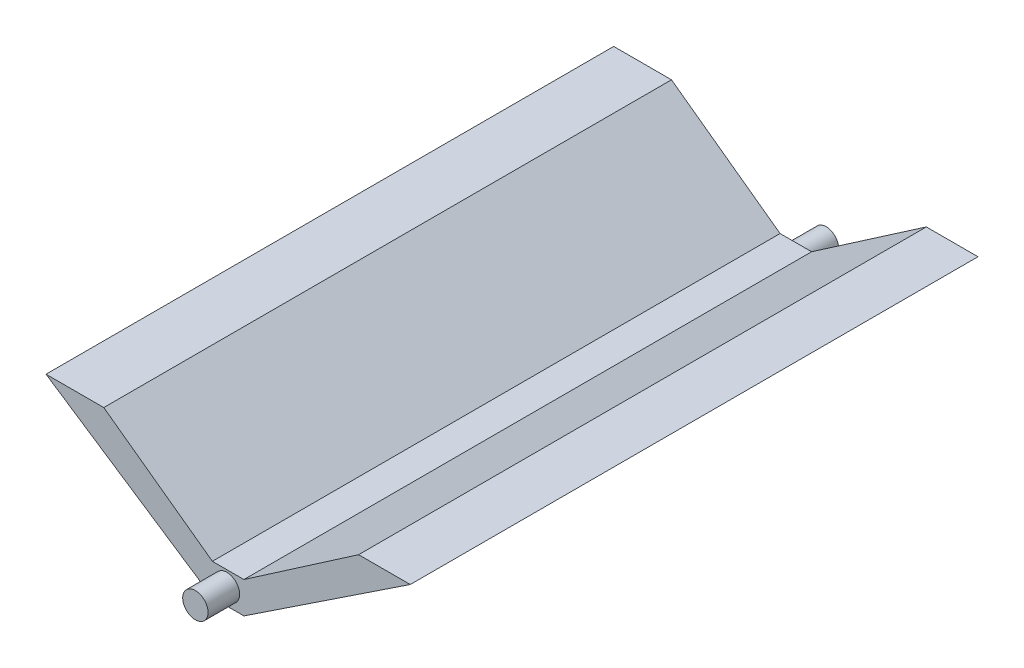
ISO-10303-21;
HEADER;
FILE_DESCRIPTION(('STEP AP214'),'2;1');
FILE_NAME('part.step','',(''),(''),'','','');
FILE_SCHEMA(('AUTOMOTIVE_DESIGN { 1 0 10303 214 1 1 1 1 }'));
ENDSEC;
DATA;
#1=APPLICATION_CONTEXT('core data for automotive mechanical design processes');
#2=APPLICATION_PROTOCOL_DEFINITION('international standard','automotive_design',2000,#1);
#3=PRODUCT_CONTEXT('',#1,'mechanical');
#4=PRODUCT('Part','Part','',(#3));
#5=PRODUCT_RELATED_PRODUCT_CATEGORY('part','',(#4));
#6=PRODUCT_DEFINITION_FORMATION('','',#4);
#7=PRODUCT_DEFINITION_CONTEXT('part definition',#1,'design');
#8=PRODUCT_DEFINITION('design','',#6,#7);
#9=PRODUCT_DEFINITION_SHAPE('','',#8);
#10=(LENGTH_UNIT() NAMED_UNIT(*) SI_UNIT(.MILLI.,.METRE.));
#11=(NAMED_UNIT(*) PLANE_ANGLE_UNIT() SI_UNIT($,.RADIAN.));
#12=(NAMED_UNIT(*) SI_UNIT($,.STERADIAN.) SOLID_ANGLE_UNIT());
#13=UNCERTAINTY_MEASURE_WITH_UNIT(LENGTH_MEASURE(1.E-05),#10,'distance_accuracy_value','');
#14=(GEOMETRIC_REPRESENTATION_CONTEXT(3) GLOBAL_UNCERTAINTY_ASSIGNED_CONTEXT((#13)) GLOBAL_UNIT_ASSIGNED_CONTEXT((#10,
#11,#12)) REPRESENTATION_CONTEXT('',''));
#15=CARTESIAN_POINT('',(0.,0.,0.));
#16=DIRECTION('',(0.,0.,1.));
#17=DIRECTION('',(1.,0.,0.));
#18=AXIS2_PLACEMENT_3D('',#15,#16,#17);
#19=CARTESIAN_POINT('',(115.5,32.5935990338164,360.));
#20=DIRECTION('',(0.,-1.,0.));
#21=DIRECTION('',(0.,0.,-1.));
#22=AXIS2_PLACEMENT_3D('',#19,#20,#21);
#23=PLANE('',#22);
#24=DIRECTION('',(-1.,0.,0.));
#25=VECTOR('',#24,1.);
#26=CARTESIAN_POINT('',(115.5,32.5935990338164,360.));
#27=LINE('',#26,#25);
#28=CARTESIAN_POINT('',(-78.8670896562479,32.5935990338164,360.));
#29=VERTEX_POINT('',#28);
#30=CARTESIAN_POINT('',(-115.5,32.5935990338164,360.));
#31=VERTEX_POINT('',#30);
#32=EDGE_CURVE('E89',#29,#31,#27,.T.);
#33=ORIENTED_EDGE('',*,*,#32,.F.);
#34=DIRECTION('',(0.,0.,1.));
#35=VECTOR('',#34,1.);
#36=CARTESIAN_POINT('',(-78.8670896562479,32.5935990338164,0.));
#37=LINE('',#36,#35);
#38=CARTESIAN_POINT('',(-78.8670896562479,32.5935990338164,0.));
#39=VERTEX_POINT('',#38);
#40=EDGE_CURVE('E144',#39,#29,#37,.T.);
#41=ORIENTED_EDGE('',*,*,#40,.F.);
#42=DIRECTION('',(-1.,0.,0.));
#43=VECTOR('',#42,1.);
#44=CARTESIAN_POINT('',(115.5,32.5935990338164,0.));
#45=LINE('',#44,#43);
#46=CARTESIAN_POINT('',(-115.5,32.5935990338164,0.));
#47=VERTEX_POINT('',#46);
#48=EDGE_CURVE('E131',#39,#47,#45,.T.);
#49=ORIENTED_EDGE('',*,*,#48,.T.);
#50=DIRECTION('',(0.,0.,-1.));
#51=VECTOR('',#50,1.);
#52=CARTESIAN_POINT('',(-115.5,32.5935990338164,360.));
#53=LINE('',#52,#51);
#54=EDGE_CURVE('E45',#31,#47,#53,.T.);
#55=ORIENTED_EDGE('',*,*,#54,.F.);
#56=EDGE_LOOP('',(#33,#41,#49,#55));
#57=FACE_BOUND('',#56,.T.);
#58=ADVANCED_FACE('F37',(#57),#23,.F.);
#59=CARTESIAN_POINT('',(115.5,32.5935990338164,0.));
#60=VERTEX_POINT('',#59);
#61=CARTESIAN_POINT('',(82.7331234629267,32.5935990338164,0.));
#62=VERTEX_POINT('',#61);
#63=EDGE_CURVE('E158',#60,#62,#45,.T.);
#64=ORIENTED_EDGE('',*,*,#63,.T.);
#65=DIRECTION('',(0.,0.,1.));
#66=VECTOR('',#65,1.);
#67=CARTESIAN_POINT('',(82.7331234629267,32.5935990338164,0.));
#68=LINE('',#67,#66);
#69=CARTESIAN_POINT('',(82.7331234629267,32.5935990338164,360.));
#70=VERTEX_POINT('',#69);
#71=EDGE_CURVE('E146',#62,#70,#68,.T.);
#72=ORIENTED_EDGE('',*,*,#71,.T.);
#73=CARTESIAN_POINT('',(115.5,32.5935990338164,360.));
#74=VERTEX_POINT('',#73);
#75=EDGE_CURVE('E150',#74,#70,#27,.T.);
#76=ORIENTED_EDGE('',*,*,#75,.F.);
#77=DIRECTION('',(0.,0.,-1.));
#78=VECTOR('',#77,1.);
#79=CARTESIAN_POINT('',(115.5,32.5935990338164,360.));
#80=LINE('',#79,#78);
#81=EDGE_CURVE('E157',#74,#60,#80,.T.);
#82=ORIENTED_EDGE('',*,*,#81,.T.);
#83=EDGE_LOOP('',(#64,#72,#76,#82));
#84=FACE_BOUND('',#83,.T.);
#85=ADVANCED_FACE('F39',(#84),#23,.F.);
#86=CARTESIAN_POINT('',(-115.5,32.5935990338164,360.));
#87=DIRECTION('',(0.552876196546105,0.833263410508773,0.));
#88=DIRECTION('',(-0.833263410508773,0.552876196546106,0.));
#89=AXIS2_PLACEMENT_3D('',#86,#87,#88);
#90=PLANE('',#89);
#91=DIRECTION('',(0.833263410508773,-0.552876196546106,0.));
#92=VECTOR('',#91,1.);
#93=CARTESIAN_POINT('',(-115.5,32.5935990338164,0.));
#94=LINE('',#93,#92);
#95=CARTESIAN_POINT('',(-10.,-37.4064009661836,0.));
#96=VERTEX_POINT('',#95);
#97=EDGE_CURVE('E161',#47,#96,#94,.T.);
#98=ORIENTED_EDGE('',*,*,#97,.T.);
#99=DIRECTION('',(0.,0.,-1.));
#100=VECTOR('',#99,1.);
#101=CARTESIAN_POINT('',(-10.,-37.4064009661836,360.));
#102=LINE('',#101,#100);
#103=CARTESIAN_POINT('',(-10.,-37.4064009661836,360.));
#104=VERTEX_POINT('',#103);
#105=EDGE_CURVE('E169',#104,#96,#102,.T.);
#106=ORIENTED_EDGE('',*,*,#105,.F.);
#107=DIRECTION('',(0.833263410508773,-0.552876196546106,0.));
#108=VECTOR('',#107,1.);
#109=CARTESIAN_POINT('',(-115.5,32.5935990338164,360.));
#110=LINE('',#109,#108);
#111=EDGE_CURVE('E152',#31,#104,#110,.T.);
#112=ORIENTED_EDGE('',*,*,#111,.F.);
#113=ORIENTED_EDGE('',*,*,#54,.T.);
#114=EDGE_LOOP('',(#98,#106,#112,#113));
#115=FACE_BOUND('',#114,.T.);
#116=ADVANCED_FACE('F174',(#115),#90,.F.);
#117=CARTESIAN_POINT('',(10.,-37.4064009661836,360.));
#118=DIRECTION('',(0.,1.,0.));
#119=DIRECTION('',(0.,0.,1.));
#120=AXIS2_PLACEMENT_3D('',#117,#118,#119);
#121=PLANE('',#120);
#122=DIRECTION('',(1.,0.,0.));
#123=VECTOR('',#122,1.);
#124=CARTESIAN_POINT('',(10.,-37.4064009661836,0.));
#125=LINE('',#124,#123);
#126=CARTESIAN_POINT('',(10.,-37.4064009661836,0.));
#127=VERTEX_POINT('',#126);
#128=EDGE_CURVE('E163',#96,#127,#125,.T.);
#129=ORIENTED_EDGE('',*,*,#128,.T.);
#130=DIRECTION('',(0.,0.,-1.));
#131=VECTOR('',#130,1.);
#132=CARTESIAN_POINT('',(10.,-37.4064009661836,360.));
#133=LINE('',#132,#131);
#134=CARTESIAN_POINT('',(10.,-37.4064009661836,360.));
#135=VERTEX_POINT('',#134);
#136=EDGE_CURVE('E167',#135,#127,#133,.T.);
#137=ORIENTED_EDGE('',*,*,#136,.F.);
#138=DIRECTION('',(1.,0.,0.));
#139=VECTOR('',#138,1.);
#140=CARTESIAN_POINT('',(10.,-37.4064009661836,360.));
#141=LINE('',#140,#139);
#142=EDGE_CURVE('E154',#104,#135,#141,.T.);
#143=ORIENTED_EDGE('',*,*,#142,.F.);
#144=ORIENTED_EDGE('',*,*,#105,.T.);
#145=EDGE_LOOP('',(#129,#137,#143,#144));
#146=FACE_BOUND('',#145,.T.);
#147=ADVANCED_FACE('F181',(#146),#121,.F.);
#148=CARTESIAN_POINT('',(10.,-37.4064009661836,360.));
#149=DIRECTION('',(-0.552876196546105,0.833263410508773,0.));
#150=DIRECTION('',(-0.833263410508773,-0.552876196546106,0.));
#151=AXIS2_PLACEMENT_3D('',#148,#149,#150);
#152=PLANE('',#151);
#153=DIRECTION('',(0.833263410508773,0.552876196546106,0.));
#154=VECTOR('',#153,1.);
#155=CARTESIAN_POINT('',(10.,-37.4064009661836,0.));
#156=LINE('',#155,#154);
#157=EDGE_CURVE('E82',#127,#60,#156,.T.);
#158=ORIENTED_EDGE('',*,*,#157,.T.);
#159=ORIENTED_EDGE('',*,*,#81,.F.);
#160=DIRECTION('',(0.833263410508773,0.552876196546106,0.));
#161=VECTOR('',#160,1.);
#162=CARTESIAN_POINT('',(10.,-37.4064009661836,360.));
#163=LINE('',#162,#161);
#164=EDGE_CURVE('E61',#135,#74,#163,.T.);
#165=ORIENTED_EDGE('',*,*,#164,.F.);
#166=ORIENTED_EDGE('',*,*,#136,.T.);
#167=EDGE_LOOP('',(#158,#159,#165,#166));
#168=FACE_BOUND('',#167,.T.);
#169=ADVANCED_FACE('F183',(#168),#152,.F.);
#170=CARTESIAN_POINT('',(0.,0.,360.));
#171=DIRECTION('',(0.,0.,1.));
#172=DIRECTION('',(1.,0.,0.));
#173=AXIS2_PLACEMENT_3D('',#170,#171,#172);
#174=PLANE('',#173);
#175=CARTESIAN_POINT('',(-0.773206761335771,-26.8912817418148,360.));
#176=DIRECTION('',(0.,0.,1.));
#177=DIRECTION('',(1.,0.,0.));
#178=AXIS2_PLACEMENT_3D('',#175,#176,#177);
#179=CIRCLE('',#178,8.05);
#180=CARTESIAN_POINT('',(7.27679323866423,-26.8912817418148,360.));
#181=VERTEX_POINT('',#180);
#182=EDGE_CURVE('E137',#181,#181,#179,.T.);
#183=ORIENTED_EDGE('',*,*,#182,.F.);
#184=EDGE_LOOP('',(#183));
#185=FACE_BOUND('',#184,.T.);
#186=DIRECTION('',(0.809211786942428,-0.587517049857655,0.));
#187=VECTOR('',#186,1.);
#188=CARTESIAN_POINT('',(-10.,-17.4064009661836,360.));
#189=LINE('',#188,#187);
#190=CARTESIAN_POINT('',(-10.,-17.4064009661836,360.));
#191=VERTEX_POINT('',#190);
#192=EDGE_CURVE('E117',#29,#191,#189,.T.);
#193=ORIENTED_EDGE('',*,*,#192,.F.);
#194=ORIENTED_EDGE('',*,*,#32,.T.);
#195=ORIENTED_EDGE('',*,*,#111,.T.);
#196=ORIENTED_EDGE('',*,*,#142,.T.);
#197=ORIENTED_EDGE('',*,*,#164,.T.);
#198=ORIENTED_EDGE('',*,*,#75,.T.);
#199=DIRECTION('',(0.824063199265385,0.566497876091781,0.));
#200=VECTOR('',#199,1.);
#201=CARTESIAN_POINT('',(10.,-17.4064009661836,360.));
#202=LINE('',#201,#200);
#203=CARTESIAN_POINT('',(10.,-17.4064009661836,360.));
#204=VERTEX_POINT('',#203);
#205=EDGE_CURVE('E132',#204,#70,#202,.T.);
#206=ORIENTED_EDGE('',*,*,#205,.F.);
#207=DIRECTION('',(1.,0.,0.));
#208=VECTOR('',#207,1.);
#209=CARTESIAN_POINT('',(-10.,-17.4064009661836,360.));
#210=LINE('',#209,#208);
#211=EDGE_CURVE('E134',#191,#204,#210,.T.);
#212=ORIENTED_EDGE('',*,*,#211,.F.);
#213=EDGE_LOOP('',(#193,#194,#195,#196,#197,#198,#206,#212));
#214=FACE_BOUND('',#213,.T.);
#215=ADVANCED_FACE('F187',(#185,#214),#174,.T.);
#216=CARTESIAN_POINT('',(0.,0.,0.));
#217=DIRECTION('',(0.,0.,1.));
#218=DIRECTION('',(1.,0.,0.));
#219=AXIS2_PLACEMENT_3D('',#216,#217,#218);
#220=PLANE('',#219);
#221=CARTESIAN_POINT('',(-0.773206761335771,-26.8912817418148,0.));
#222=DIRECTION('',(0.,0.,1.));
#223=DIRECTION('',(1.,0.,0.));
#224=AXIS2_PLACEMENT_3D('',#221,#222,#223);
#225=CIRCLE('',#224,7.87377693535657);
#226=CARTESIAN_POINT('',(7.10057017402079,-26.8912817418148,0.));
#227=VERTEX_POINT('',#226);
#228=EDGE_CURVE('E11',#227,#227,#225,.F.);
#229=ORIENTED_EDGE('',*,*,#228,.F.);
#230=EDGE_LOOP('',(#229));
#231=FACE_BOUND('',#230,.T.);
#232=ORIENTED_EDGE('',*,*,#48,.F.);
#233=DIRECTION('',(0.809211786942428,-0.587517049857655,0.));
#234=VECTOR('',#233,1.);
#235=CARTESIAN_POINT('',(-10.,-17.4064009661836,0.));
#236=LINE('',#235,#234);
#237=CARTESIAN_POINT('',(-10.,-17.4064009661836,0.));
#238=VERTEX_POINT('',#237);
#239=EDGE_CURVE('E115',#39,#238,#236,.T.);
#240=ORIENTED_EDGE('',*,*,#239,.T.);
#241=DIRECTION('',(1.,0.,0.));
#242=VECTOR('',#241,1.);
#243=CARTESIAN_POINT('',(-10.,-17.4064009661836,0.));
#244=LINE('',#243,#242);
#245=CARTESIAN_POINT('',(10.,-17.4064009661836,0.));
#246=VERTEX_POINT('',#245);
#247=EDGE_CURVE('E124',#238,#246,#244,.T.);
#248=ORIENTED_EDGE('',*,*,#247,.T.);
#249=DIRECTION('',(0.824063199265385,0.566497876091781,0.));
#250=VECTOR('',#249,1.);
#251=CARTESIAN_POINT('',(10.,-17.4064009661836,0.));
#252=LINE('',#251,#250);
#253=EDGE_CURVE('E52',#246,#62,#252,.T.);
#254=ORIENTED_EDGE('',*,*,#253,.T.);
#255=ORIENTED_EDGE('',*,*,#63,.F.);
#256=ORIENTED_EDGE('',*,*,#157,.F.);
#257=ORIENTED_EDGE('',*,*,#128,.F.);
#258=ORIENTED_EDGE('',*,*,#97,.F.);
#259=EDGE_LOOP('',(#232,#240,#248,#254,#255,#256,#257,#258));
#260=FACE_BOUND('',#259,.T.);
#261=ADVANCED_FACE('F129',(#231,#260),#220,.F.);
#262=CARTESIAN_POINT('',(-10.,-17.4064009661836,0.));
#263=DIRECTION('',(-0.587517049857655,-0.809211786942428,0.));
#264=DIRECTION('',(0.809211786942428,-0.587517049857655,0.));
#265=AXIS2_PLACEMENT_3D('',#262,#263,#264);
#266=PLANE('',#265);
#267=ORIENTED_EDGE('',*,*,#192,.T.);
#268=DIRECTION('',(0.,0.,1.));
#269=VECTOR('',#268,1.);
#270=CARTESIAN_POINT('',(-10.,-17.4064009661836,0.));
#271=LINE('',#270,#269);
#272=EDGE_CURVE('E111',#238,#191,#271,.T.);
#273=ORIENTED_EDGE('',*,*,#272,.F.);
#274=ORIENTED_EDGE('',*,*,#239,.F.);
#275=ORIENTED_EDGE('',*,*,#40,.T.);
#276=EDGE_LOOP('',(#267,#273,#274,#275));
#277=FACE_BOUND('',#276,.T.);
#278=ADVANCED_FACE('F113',(#277),#266,.F.);
#279=CARTESIAN_POINT('',(10.,-17.4064009661836,0.));
#280=DIRECTION('',(0.566497876091781,-0.824063199265385,0.));
#281=DIRECTION('',(0.824063199265385,0.566497876091781,0.));
#282=AXIS2_PLACEMENT_3D('',#279,#280,#281);
#283=PLANE('',#282);
#284=ORIENTED_EDGE('',*,*,#205,.T.);
#285=ORIENTED_EDGE('',*,*,#71,.F.);
#286=ORIENTED_EDGE('',*,*,#253,.F.);
#287=DIRECTION('',(0.,0.,1.));
#288=VECTOR('',#287,1.);
#289=CARTESIAN_POINT('',(10.,-17.4064009661836,0.));
#290=LINE('',#289,#288);
#291=EDGE_CURVE('E121',#246,#204,#290,.T.);
#292=ORIENTED_EDGE('',*,*,#291,.T.);
#293=EDGE_LOOP('',(#284,#285,#286,#292));
#294=FACE_BOUND('',#293,.T.);
#295=ADVANCED_FACE('F188',(#294),#283,.F.);
#296=CARTESIAN_POINT('',(-10.,-17.4064009661836,0.));
#297=DIRECTION('',(0.,-1.,0.));
#298=DIRECTION('',(0.,0.,-1.));
#299=AXIS2_PLACEMENT_3D('',#296,#297,#298);
#300=PLANE('',#299);
#301=ORIENTED_EDGE('',*,*,#211,.T.);
#302=ORIENTED_EDGE('',*,*,#291,.F.);
#303=ORIENTED_EDGE('',*,*,#247,.F.);
#304=ORIENTED_EDGE('',*,*,#272,.T.);
#305=EDGE_LOOP('',(#301,#302,#303,#304));
#306=FACE_BOUND('',#305,.T.);
#307=ADVANCED_FACE('F125',(#306),#300,.F.);
#308=CARTESIAN_POINT('',(-0.773206761335771,-26.8912817418148,380.));
#309=DIRECTION('',(0.,0.,-1.));
#310=DIRECTION('',(-1.,0.,0.));
#311=AXIS2_PLACEMENT_3D('',#308,#309,#310);
#312=CYLINDRICAL_SURFACE('',#311,8.05);
#313=CARTESIAN_POINT('',(-0.773206761335771,-26.8912817418148,380.));
#314=DIRECTION('',(0.,0.,1.));
#315=DIRECTION('',(1.,0.,0.));
#316=AXIS2_PLACEMENT_3D('',#313,#314,#315);
#317=CIRCLE('',#316,8.05);
#318=CARTESIAN_POINT('',(7.27679323866423,-26.8912817418148,380.));
#319=VERTEX_POINT('',#318);
#320=EDGE_CURVE('E142',#319,#319,#317,.T.);
#321=ORIENTED_EDGE('',*,*,#320,.F.);
#322=EDGE_LOOP('',(#321));
#323=FACE_BOUND('',#322,.T.);
#324=ORIENTED_EDGE('',*,*,#182,.T.);
#325=EDGE_LOOP('',(#324));
#326=FACE_BOUND('',#325,.T.);
#327=ADVANCED_FACE('F195',(#323,#326),#312,.T.);
#328=CARTESIAN_POINT('',(-0.773206761335771,-26.8912817418148,380.));
#329=DIRECTION('',(0.,0.,1.));
#330=DIRECTION('',(1.,0.,0.));
#331=AXIS2_PLACEMENT_3D('',#328,#329,#330);
#332=PLANE('',#331);
#333=ORIENTED_EDGE('',*,*,#320,.T.);
#334=EDGE_LOOP('',(#333));
#335=FACE_BOUND('',#334,.T.);
#336=ADVANCED_FACE('F234',(#335),#332,.T.);
#337=CARTESIAN_POINT('',(-0.773206761335771,-26.8912817418148,-20.));
#338=DIRECTION('',(0.,0.,1.));
#339=DIRECTION('',(1.,0.,0.));
#340=AXIS2_PLACEMENT_3D('',#337,#338,#339);
#341=CYLINDRICAL_SURFACE('',#340,7.87377693535657);
#342=CARTESIAN_POINT('',(-0.773206761335771,-26.8912817418148,-20.));
#343=DIRECTION('',(0.,0.,-1.));
#344=DIRECTION('',(-1.,0.,0.));
#345=AXIS2_PLACEMENT_3D('',#342,#343,#344);
#346=CIRCLE('',#345,7.87377693535657);
#347=CARTESIAN_POINT('',(-8.64698369669234,-26.8912817418148,-20.));
#348=VERTEX_POINT('',#347);
#349=EDGE_CURVE('E223',#348,#348,#346,.T.);
#350=ORIENTED_EDGE('',*,*,#349,.F.);
#351=EDGE_LOOP('',(#350));
#352=FACE_BOUND('',#351,.T.);
#353=ORIENTED_EDGE('',*,*,#228,.T.);
#354=EDGE_LOOP('',(#353));
#355=FACE_BOUND('',#354,.T.);
#356=ADVANCED_FACE('F231',(#352,#355),#341,.T.);
#357=CARTESIAN_POINT('',(-0.773206761335771,-26.8912817418148,-20.));
#358=DIRECTION('',(0.,0.,-1.));
#359=DIRECTION('',(-1.,0.,0.));
#360=AXIS2_PLACEMENT_3D('',#357,#358,#359);
#361=PLANE('',#360);
#362=ORIENTED_EDGE('',*,*,#349,.T.);
#363=EDGE_LOOP('',(#362));
#364=FACE_BOUND('',#363,.T.);
#365=ADVANCED_FACE('F229',(#364),#361,.T.);
#366=CLOSED_SHELL('',(#58,#85,#116,#147,#169,#215,#261,#278,#295,#307,#327,#336,#356,#365));
#367=MANIFOLD_SOLID_BREP('B2',#366);
#368=ADVANCED_BREP_SHAPE_REPRESENTATION('',(#18,#367),#14);
#369=SHAPE_DEFINITION_REPRESENTATION(#9,#368);
ENDSEC;
END-ISO-10303-21;
